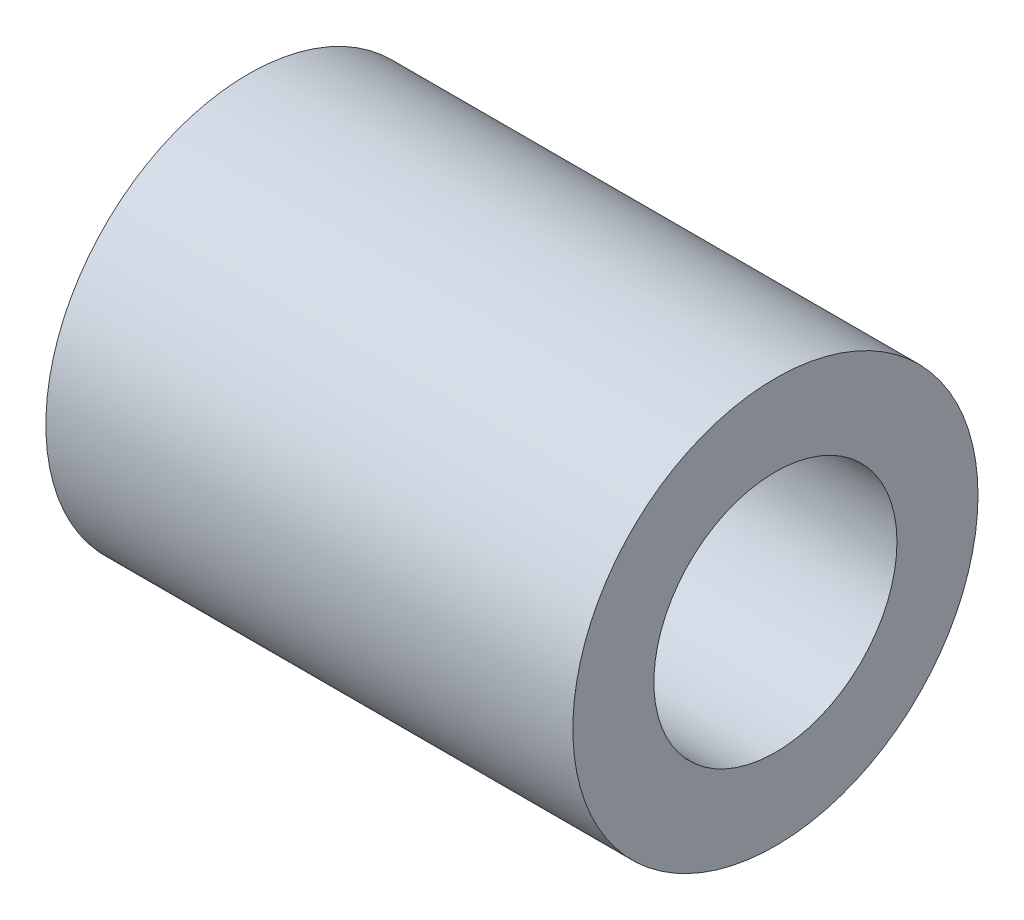
ISO-10303-21;
HEADER;
FILE_DESCRIPTION(('STEP AP214'),'2;1');
FILE_NAME('part.step','',(''),(''),'','','');
FILE_SCHEMA(('AUTOMOTIVE_DESIGN { 1 0 10303 214 1 1 1 1 }'));
ENDSEC;
DATA;
#1=APPLICATION_CONTEXT('core data for automotive mechanical design processes');
#2=APPLICATION_PROTOCOL_DEFINITION('international standard','automotive_design',2000,#1);
#3=PRODUCT_CONTEXT('',#1,'mechanical');
#4=PRODUCT('Part','Part','',(#3));
#5=PRODUCT_RELATED_PRODUCT_CATEGORY('part','',(#4));
#6=PRODUCT_DEFINITION_FORMATION('','',#4);
#7=PRODUCT_DEFINITION_CONTEXT('part definition',#1,'design');
#8=PRODUCT_DEFINITION('design','',#6,#7);
#9=PRODUCT_DEFINITION_SHAPE('','',#8);
#10=(LENGTH_UNIT() NAMED_UNIT(*) SI_UNIT(.MILLI.,.METRE.));
#11=(NAMED_UNIT(*) PLANE_ANGLE_UNIT() SI_UNIT($,.RADIAN.));
#12=(NAMED_UNIT(*) SI_UNIT($,.STERADIAN.) SOLID_ANGLE_UNIT());
#13=UNCERTAINTY_MEASURE_WITH_UNIT(LENGTH_MEASURE(1.E-05),#10,'distance_accuracy_value','');
#14=(GEOMETRIC_REPRESENTATION_CONTEXT(3) GLOBAL_UNCERTAINTY_ASSIGNED_CONTEXT((#13)) GLOBAL_UNIT_ASSIGNED_CONTEXT((#10,
#11,#12)) REPRESENTATION_CONTEXT('',''));
#15=CARTESIAN_POINT('',(0.,0.,0.));
#16=DIRECTION('',(0.,0.,1.));
#17=DIRECTION('',(1.,0.,0.));
#18=AXIS2_PLACEMENT_3D('',#15,#16,#17);
#19=CARTESIAN_POINT('',(20.6502,0.,0.));
#20=DIRECTION('',(1.,0.,0.));
#21=DIRECTION('',(0.,0.,-1.));
#22=AXIS2_PLACEMENT_3D('',#19,#20,#21);
#23=PLANE('',#22);
#24=CARTESIAN_POINT('',(20.6502,0.,0.));
#25=DIRECTION('',(1.,0.,0.));
#26=DIRECTION('',(0.,0.,-1.));
#27=AXIS2_PLACEMENT_3D('',#24,#25,#26);
#28=CIRCLE('',#27,7.9375);
#29=CARTESIAN_POINT('',(20.6502,0.,-7.9375));
#30=VERTEX_POINT('',#29);
#31=EDGE_CURVE('E10',#30,#30,#28,.T.);
#32=ORIENTED_EDGE('',*,*,#31,.T.);
#33=EDGE_LOOP('',(#32));
#34=FACE_BOUND('',#33,.T.);
#35=CARTESIAN_POINT('',(20.6502,0.,0.));
#36=DIRECTION('',(1.,0.,0.));
#37=DIRECTION('',(0.,0.,-1.));
#38=AXIS2_PLACEMENT_3D('',#35,#36,#37);
#39=CIRCLE('',#38,4.7625);
#40=CARTESIAN_POINT('',(20.6502,0.,-4.7625));
#41=VERTEX_POINT('',#40);
#42=EDGE_CURVE('E42',#41,#41,#39,.T.);
#43=ORIENTED_EDGE('',*,*,#42,.F.);
#44=EDGE_LOOP('',(#43));
#45=FACE_BOUND('',#44,.T.);
#46=ADVANCED_FACE('F31',(#34,#45),#23,.T.);
#47=CARTESIAN_POINT('',(0.,0.,0.));
#48=DIRECTION('',(1.,0.,0.));
#49=DIRECTION('',(0.,0.,-1.));
#50=AXIS2_PLACEMENT_3D('',#47,#48,#49);
#51=PLANE('',#50);
#52=CARTESIAN_POINT('',(0.,0.,0.));
#53=DIRECTION('',(1.,0.,0.));
#54=DIRECTION('',(0.,0.,-1.));
#55=AXIS2_PLACEMENT_3D('',#52,#53,#54);
#56=CIRCLE('',#55,7.9375);
#57=CARTESIAN_POINT('',(0.,0.,-7.9375));
#58=VERTEX_POINT('',#57);
#59=EDGE_CURVE('E35',#58,#58,#56,.T.);
#60=ORIENTED_EDGE('',*,*,#59,.F.);
#61=EDGE_LOOP('',(#60));
#62=FACE_BOUND('',#61,.T.);
#63=CARTESIAN_POINT('',(0.,0.,0.));
#64=DIRECTION('',(1.,0.,0.));
#65=DIRECTION('',(0.,0.,-1.));
#66=AXIS2_PLACEMENT_3D('',#63,#64,#65);
#67=CIRCLE('',#66,4.7625);
#68=CARTESIAN_POINT('',(0.,0.,-4.7625));
#69=VERTEX_POINT('',#68);
#70=EDGE_CURVE('E44',#69,#69,#67,.T.);
#71=ORIENTED_EDGE('',*,*,#70,.T.);
#72=EDGE_LOOP('',(#71));
#73=FACE_BOUND('',#72,.T.);
#74=ADVANCED_FACE('F54',(#62,#73),#51,.F.);
#75=CARTESIAN_POINT('',(20.6502,0.,0.));
#76=DIRECTION('',(-1.,0.,0.));
#77=DIRECTION('',(0.,0.,1.));
#78=AXIS2_PLACEMENT_3D('',#75,#76,#77);
#79=CYLINDRICAL_SURFACE('',#78,7.9375);
#80=ORIENTED_EDGE('',*,*,#31,.F.);
#81=EDGE_LOOP('',(#80));
#82=FACE_BOUND('',#81,.T.);
#83=ORIENTED_EDGE('',*,*,#59,.T.);
#84=EDGE_LOOP('',(#83));
#85=FACE_BOUND('',#84,.T.);
#86=ADVANCED_FACE('F33',(#82,#85),#79,.T.);
#87=CARTESIAN_POINT('',(20.6502,0.,0.));
#88=DIRECTION('',(-1.,0.,0.));
#89=DIRECTION('',(0.,0.,1.));
#90=AXIS2_PLACEMENT_3D('',#87,#88,#89);
#91=CYLINDRICAL_SURFACE('',#90,4.7625);
#92=ORIENTED_EDGE('',*,*,#42,.T.);
#93=EDGE_LOOP('',(#92));
#94=FACE_BOUND('',#93,.T.);
#95=ORIENTED_EDGE('',*,*,#70,.F.);
#96=EDGE_LOOP('',(#95));
#97=FACE_BOUND('',#96,.T.);
#98=ADVANCED_FACE('F50',(#94,#97),#91,.F.);
#99=CLOSED_SHELL('',(#46,#74,#86,#98));
#100=MANIFOLD_SOLID_BREP('B2',#99);
#101=ADVANCED_BREP_SHAPE_REPRESENTATION('',(#18,#100),#14);
#102=SHAPE_DEFINITION_REPRESENTATION(#9,#101);
ENDSEC;
END-ISO-10303-21;
